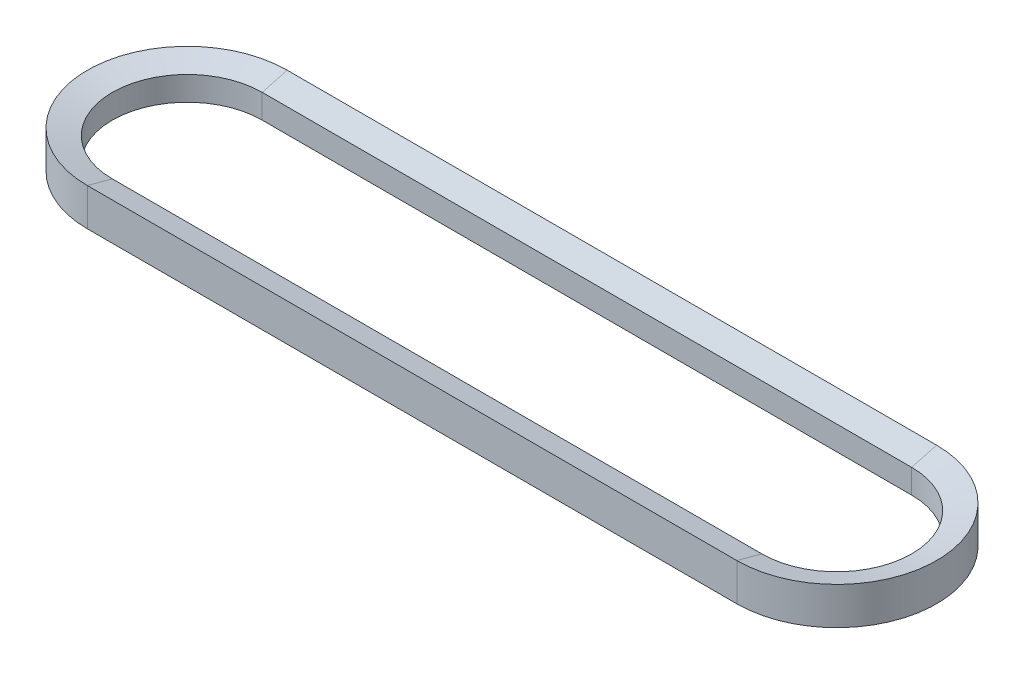
ISO-10303-21;
HEADER;
FILE_DESCRIPTION(('STEP AP214'),'2;1');
FILE_NAME('part.step','',(''),(''),'','','');
FILE_SCHEMA(('AUTOMOTIVE_DESIGN { 1 0 10303 214 1 1 1 1 }'));
ENDSEC;
DATA;
#1=APPLICATION_CONTEXT('core data for automotive mechanical design processes');
#2=APPLICATION_PROTOCOL_DEFINITION('international standard','automotive_design',2000,#1);
#3=PRODUCT_CONTEXT('',#1,'mechanical');
#4=PRODUCT('Part','Part','',(#3));
#5=PRODUCT_RELATED_PRODUCT_CATEGORY('part','',(#4));
#6=PRODUCT_DEFINITION_FORMATION('','',#4);
#7=PRODUCT_DEFINITION_CONTEXT('part definition',#1,'design');
#8=PRODUCT_DEFINITION('design','',#6,#7);
#9=PRODUCT_DEFINITION_SHAPE('','',#8);
#10=(LENGTH_UNIT() NAMED_UNIT(*) SI_UNIT(.MILLI.,.METRE.));
#11=(NAMED_UNIT(*) PLANE_ANGLE_UNIT() SI_UNIT($,.RADIAN.));
#12=(NAMED_UNIT(*) SI_UNIT($,.STERADIAN.) SOLID_ANGLE_UNIT());
#13=UNCERTAINTY_MEASURE_WITH_UNIT(LENGTH_MEASURE(1.E-05),#10,'distance_accuracy_value','');
#14=(GEOMETRIC_REPRESENTATION_CONTEXT(3) GLOBAL_UNCERTAINTY_ASSIGNED_CONTEXT((#13)) GLOBAL_UNIT_ASSIGNED_CONTEXT((#10,
#11,#12)) REPRESENTATION_CONTEXT('',''));
#15=CARTESIAN_POINT('',(0.,0.,0.));
#16=DIRECTION('',(0.,0.,1.));
#17=DIRECTION('',(1.,0.,0.));
#18=AXIS2_PLACEMENT_3D('',#15,#16,#17);
#19=CARTESIAN_POINT('',(-165.1,6.12204525612479,0.));
#20=DIRECTION('',(0.,1.,0.));
#21=DIRECTION('',(0.,0.,1.));
#22=AXIS2_PLACEMENT_3D('',#19,#20,#21);
#23=CONICAL_SURFACE('',#22,38.1,1.30899693899575);
#24=DIRECTION('',(0.,0.258819045102517,0.965925826289069));
#25=VECTOR('',#24,1.);
#26=CARTESIAN_POINT('',(-165.1,6.12204525612479,38.1));
#27=LINE('',#26,#25);
#28=CARTESIAN_POINT('',(-165.1,6.12204525612479,38.1));
#29=VERTEX_POINT('',#28);
#30=CARTESIAN_POINT('',(-165.1,9.525,50.8));
#31=VERTEX_POINT('',#30);
#32=EDGE_CURVE('E168',#29,#31,#27,.T.);
#33=ORIENTED_EDGE('',*,*,#32,.F.);
#34=CARTESIAN_POINT('',(-165.1,6.12204525612479,0.));
#35=DIRECTION('',(0.,-1.,0.));
#36=DIRECTION('',(0.,0.,-1.));
#37=AXIS2_PLACEMENT_3D('',#34,#35,#36);
#38=CIRCLE('',#37,38.1);
#39=CARTESIAN_POINT('',(-165.1,6.12204525612479,-38.1));
#40=VERTEX_POINT('',#39);
#41=EDGE_CURVE('E44',#29,#40,#38,.T.);
#42=ORIENTED_EDGE('',*,*,#41,.T.);
#43=CARTESIAN_POINT('',(-165.1,6.12204525612479,-38.1));
#44=DIRECTION('',(0.,0.258819045102517,-0.965925826289069));
#45=VECTOR('',#44,1.);
#46=LINE('',#43,#45);
#47=CARTESIAN_POINT('',(-165.1,9.525,-50.8));
#48=VERTEX_POINT('',#47);
#49=EDGE_CURVE('E279',#40,#48,#46,.T.);
#50=ORIENTED_EDGE('',*,*,#49,.T.);
#51=CARTESIAN_POINT('',(-165.1,9.525,0.));
#52=DIRECTION('',(0.,-1.,0.));
#53=DIRECTION('',(0.,0.,-1.));
#54=AXIS2_PLACEMENT_3D('',#51,#52,#53);
#55=CIRCLE('',#54,50.8);
#56=EDGE_CURVE('E11',#31,#48,#55,.T.);
#57=ORIENTED_EDGE('',*,*,#56,.F.);
#58=EDGE_LOOP('',(#33,#42,#50,#57));
#59=FACE_BOUND('',#58,.T.);
#60=ADVANCED_FACE('F33',(#59),#23,.F.);
#61=CARTESIAN_POINT('',(-165.1,0.,0.));
#62=DIRECTION('',(0.,-1.,0.));
#63=DIRECTION('',(0.,0.,-1.));
#64=AXIS2_PLACEMENT_3D('',#61,#62,#63);
#65=CYLINDRICAL_SURFACE('',#64,38.1);
#66=DIRECTION('',(0.,1.,0.));
#67=VECTOR('',#66,1.);
#68=CARTESIAN_POINT('',(-165.1,-6.12204525612478,38.1));
#69=LINE('',#68,#67);
#70=CARTESIAN_POINT('',(-165.1,-6.12204525612478,38.1));
#71=VERTEX_POINT('',#70);
#72=EDGE_CURVE('E165',#71,#29,#69,.T.);
#73=ORIENTED_EDGE('',*,*,#72,.F.);
#74=CARTESIAN_POINT('',(-165.1,-6.12204525612478,0.));
#75=DIRECTION('',(0.,-1.,0.));
#76=DIRECTION('',(0.,0.,-1.));
#77=AXIS2_PLACEMENT_3D('',#74,#75,#76);
#78=CIRCLE('',#77,38.1);
#79=CARTESIAN_POINT('',(-165.1,-6.12204525612478,-38.1));
#80=VERTEX_POINT('',#79);
#81=EDGE_CURVE('E332',#71,#80,#78,.T.);
#82=ORIENTED_EDGE('',*,*,#81,.T.);
#83=CARTESIAN_POINT('',(-165.1,-6.12204525612478,-38.1));
#84=DIRECTION('',(0.,1.,0.));
#85=VECTOR('',#84,1.);
#86=LINE('',#83,#85);
#87=EDGE_CURVE('E286',#80,#40,#86,.T.);
#88=ORIENTED_EDGE('',*,*,#87,.T.);
#89=ORIENTED_EDGE('',*,*,#41,.F.);
#90=EDGE_LOOP('',(#73,#82,#88,#89));
#91=FACE_BOUND('',#90,.T.);
#92=ADVANCED_FACE('F259',(#91),#65,.F.);
#93=CARTESIAN_POINT('',(-165.1,-9.525,0.));
#94=DIRECTION('',(0.,-1.,0.));
#95=DIRECTION('',(0.,0.,-1.));
#96=AXIS2_PLACEMENT_3D('',#93,#94,#95);
#97=CONICAL_SURFACE('',#96,50.8,1.30899693899575);
#98=DIRECTION('',(0.,0.258819045102518,-0.965925826289069));
#99=VECTOR('',#98,1.);
#100=CARTESIAN_POINT('',(-165.1,-9.525,50.8));
#101=LINE('',#100,#99);
#102=CARTESIAN_POINT('',(-165.1,-9.525,50.8));
#103=VERTEX_POINT('',#102);
#104=EDGE_CURVE('E162',#103,#71,#101,.T.);
#105=ORIENTED_EDGE('',*,*,#104,.F.);
#106=CARTESIAN_POINT('',(-165.1,-9.525,0.));
#107=DIRECTION('',(0.,-1.,0.));
#108=DIRECTION('',(0.,0.,-1.));
#109=AXIS2_PLACEMENT_3D('',#106,#107,#108);
#110=CIRCLE('',#109,50.8);
#111=CARTESIAN_POINT('',(-165.1,-9.525,-50.8));
#112=VERTEX_POINT('',#111);
#113=EDGE_CURVE('E187',#103,#112,#110,.T.);
#114=ORIENTED_EDGE('',*,*,#113,.T.);
#115=CARTESIAN_POINT('',(-165.1,-9.525,-50.8));
#116=DIRECTION('',(0.,0.258819045102518,0.965925826289069));
#117=VECTOR('',#116,1.);
#118=LINE('',#115,#117);
#119=EDGE_CURVE('E131',#112,#80,#118,.T.);
#120=ORIENTED_EDGE('',*,*,#119,.T.);
#121=ORIENTED_EDGE('',*,*,#81,.F.);
#122=EDGE_LOOP('',(#105,#114,#120,#121));
#123=FACE_BOUND('',#122,.T.);
#124=ADVANCED_FACE('F200',(#123),#97,.F.);
#125=CARTESIAN_POINT('',(-165.1,0.,0.));
#126=DIRECTION('',(0.,-1.,0.));
#127=DIRECTION('',(0.,0.,-1.));
#128=AXIS2_PLACEMENT_3D('',#125,#126,#127);
#129=CYLINDRICAL_SURFACE('',#128,50.8);
#130=DIRECTION('',(0.,-1.,0.));
#131=VECTOR('',#130,1.);
#132=CARTESIAN_POINT('',(-165.1,0.,50.8));
#133=LINE('',#132,#131);
#134=EDGE_CURVE('E159',#31,#103,#133,.T.);
#135=ORIENTED_EDGE('',*,*,#134,.F.);
#136=ORIENTED_EDGE('',*,*,#56,.T.);
#137=CARTESIAN_POINT('',(-165.1,9.525,-50.8));
#138=DIRECTION('',(0.,-1.,0.));
#139=VECTOR('',#138,1.);
#140=LINE('',#137,#139);
#141=CARTESIAN_POINT('',(-165.1,0.,-50.8));
#142=VERTEX_POINT('',#141);
#143=EDGE_CURVE('E214',#48,#142,#140,.T.);
#144=ORIENTED_EDGE('',*,*,#143,.T.);
#145=CARTESIAN_POINT('',(-165.1,0.,-50.8));
#146=DIRECTION('',(0.,-1.,0.));
#147=VECTOR('',#146,1.);
#148=LINE('',#145,#147);
#149=EDGE_CURVE('E52',#142,#112,#148,.T.);
#150=ORIENTED_EDGE('',*,*,#149,.T.);
#151=ORIENTED_EDGE('',*,*,#113,.F.);
#152=EDGE_LOOP('',(#135,#136,#144,#150,#151));
#153=FACE_BOUND('',#152,.T.);
#154=ADVANCED_FACE('F189',(#153),#129,.T.);
#155=CARTESIAN_POINT('',(165.1,6.12204525612479,38.0999999999999));
#156=DIRECTION('',(0.,-0.965925826289069,0.258819045102517));
#157=DIRECTION('',(0.,-0.258819045102517,-0.965925826289069));
#158=AXIS2_PLACEMENT_3D('',#155,#156,#157);
#159=PLANE('',#158);
#160=DIRECTION('',(0.,0.258819045102517,0.965925826289069));
#161=VECTOR('',#160,1.);
#162=CARTESIAN_POINT('',(165.1,6.12204525612479,38.0999999999999));
#163=LINE('',#162,#161);
#164=CARTESIAN_POINT('',(165.1,6.12204525612479,38.0999999999999));
#165=VERTEX_POINT('',#164);
#166=CARTESIAN_POINT('',(165.1,9.525,50.7999999999999));
#167=VERTEX_POINT('',#166);
#168=EDGE_CURVE('E116',#165,#167,#163,.T.);
#169=ORIENTED_EDGE('',*,*,#168,.F.);
#170=DIRECTION('',(-1.,0.,0.));
#171=VECTOR('',#170,1.);
#172=CARTESIAN_POINT('',(165.1,6.12204525612479,38.0999999999999));
#173=LINE('',#172,#171);
#174=EDGE_CURVE('E177',#165,#29,#173,.T.);
#175=ORIENTED_EDGE('',*,*,#174,.T.);
#176=ORIENTED_EDGE('',*,*,#32,.T.);
#177=DIRECTION('',(-1.,0.,0.));
#178=VECTOR('',#177,1.);
#179=CARTESIAN_POINT('',(165.1,9.525,50.7999999999999));
#180=LINE('',#179,#178);
#181=EDGE_CURVE('E180',#167,#31,#180,.T.);
#182=ORIENTED_EDGE('',*,*,#181,.F.);
#183=EDGE_LOOP('',(#169,#175,#176,#182));
#184=FACE_BOUND('',#183,.T.);
#185=ADVANCED_FACE('F199',(#184),#159,.F.);
#186=CARTESIAN_POINT('',(165.1,-6.12204525612478,38.0999999999999));
#187=DIRECTION('',(0.,0.,1.));
#188=DIRECTION('',(1.,0.,0.));
#189=AXIS2_PLACEMENT_3D('',#186,#187,#188);
#190=PLANE('',#189);
#191=DIRECTION('',(0.,1.,0.));
#192=VECTOR('',#191,1.);
#193=CARTESIAN_POINT('',(165.1,-6.12204525612478,38.0999999999999));
#194=LINE('',#193,#192);
#195=CARTESIAN_POINT('',(165.1,-6.12204525612478,38.0999999999999));
#196=VERTEX_POINT('',#195);
#197=EDGE_CURVE('E148',#196,#165,#194,.T.);
#198=ORIENTED_EDGE('',*,*,#197,.F.);
#199=DIRECTION('',(-1.,0.,0.));
#200=VECTOR('',#199,1.);
#201=CARTESIAN_POINT('',(165.1,-6.12204525612478,38.0999999999999));
#202=LINE('',#201,#200);
#203=EDGE_CURVE('E174',#196,#71,#202,.T.);
#204=ORIENTED_EDGE('',*,*,#203,.T.);
#205=ORIENTED_EDGE('',*,*,#72,.T.);
#206=ORIENTED_EDGE('',*,*,#174,.F.);
#207=EDGE_LOOP('',(#198,#204,#205,#206));
#208=FACE_BOUND('',#207,.T.);
#209=ADVANCED_FACE('F249',(#208),#190,.F.);
#210=CARTESIAN_POINT('',(165.1,-9.525,50.7999999999999));
#211=DIRECTION('',(0.,0.965925826289069,0.258819045102518));
#212=DIRECTION('',(0.,-0.258819045102518,0.965925826289069));
#213=AXIS2_PLACEMENT_3D('',#210,#211,#212);
#214=PLANE('',#213);
#215=DIRECTION('',(0.,0.258819045102518,-0.965925826289069));
#216=VECTOR('',#215,1.);
#217=CARTESIAN_POINT('',(165.1,-9.525,50.7999999999999));
#218=LINE('',#217,#216);
#219=CARTESIAN_POINT('',(165.1,-9.525,50.7999999999999));
#220=VERTEX_POINT('',#219);
#221=EDGE_CURVE('E146',#220,#196,#218,.T.);
#222=ORIENTED_EDGE('',*,*,#221,.F.);
#223=DIRECTION('',(-1.,0.,0.));
#224=VECTOR('',#223,1.);
#225=CARTESIAN_POINT('',(165.1,-9.525,50.7999999999999));
#226=LINE('',#225,#224);
#227=EDGE_CURVE('E171',#220,#103,#226,.T.);
#228=ORIENTED_EDGE('',*,*,#227,.T.);
#229=ORIENTED_EDGE('',*,*,#104,.T.);
#230=ORIENTED_EDGE('',*,*,#203,.F.);
#231=EDGE_LOOP('',(#222,#228,#229,#230));
#232=FACE_BOUND('',#231,.T.);
#233=ADVANCED_FACE('F246',(#232),#214,.F.);
#234=CARTESIAN_POINT('',(165.1,0.,50.7999999999999));
#235=DIRECTION('',(0.,0.,-1.));
#236=DIRECTION('',(-1.,0.,0.));
#237=AXIS2_PLACEMENT_3D('',#234,#235,#236);
#238=PLANE('',#237);
#239=DIRECTION('',(0.,-1.,0.));
#240=VECTOR('',#239,1.);
#241=CARTESIAN_POINT('',(165.1,0.,50.7999999999999));
#242=LINE('',#241,#240);
#243=EDGE_CURVE('E112',#167,#220,#242,.T.);
#244=ORIENTED_EDGE('',*,*,#243,.F.);
#245=ORIENTED_EDGE('',*,*,#181,.T.);
#246=ORIENTED_EDGE('',*,*,#134,.T.);
#247=ORIENTED_EDGE('',*,*,#227,.F.);
#248=EDGE_LOOP('',(#244,#245,#246,#247));
#249=FACE_BOUND('',#248,.T.);
#250=ADVANCED_FACE('F242',(#249),#238,.F.);
#251=CARTESIAN_POINT('',(165.1,6.12204525612479,0.));
#252=DIRECTION('',(0.,1.,0.));
#253=DIRECTION('',(0.,0.,1.));
#254=AXIS2_PLACEMENT_3D('',#251,#252,#253);
#255=CONICAL_SURFACE('',#254,38.1,1.30899693899575);
#256=DIRECTION('',(0.,0.258819045102517,-0.965925826289069));
#257=VECTOR('',#256,1.);
#258=CARTESIAN_POINT('',(165.1,6.12204525612479,-38.1000000000001));
#259=LINE('',#258,#257);
#260=CARTESIAN_POINT('',(165.1,6.12204525612479,-38.1000000000001));
#261=VERTEX_POINT('',#260);
#262=CARTESIAN_POINT('',(165.1,9.525,-50.8000000000001));
#263=VERTEX_POINT('',#262);
#264=EDGE_CURVE('E134',#261,#263,#259,.T.);
#265=ORIENTED_EDGE('',*,*,#264,.F.);
#266=CARTESIAN_POINT('',(165.1,6.12204525612479,0.));
#267=DIRECTION('',(0.,-1.,0.));
#268=DIRECTION('',(0.,0.,-1.));
#269=AXIS2_PLACEMENT_3D('',#266,#267,#268);
#270=CIRCLE('',#269,38.1);
#271=EDGE_CURVE('E154',#261,#165,#270,.T.);
#272=ORIENTED_EDGE('',*,*,#271,.T.);
#273=ORIENTED_EDGE('',*,*,#168,.T.);
#274=CARTESIAN_POINT('',(165.1,9.525,0.));
#275=DIRECTION('',(0.,-1.,0.));
#276=DIRECTION('',(0.,0.,-1.));
#277=AXIS2_PLACEMENT_3D('',#274,#275,#276);
#278=CIRCLE('',#277,50.8);
#279=EDGE_CURVE('E157',#263,#167,#278,.T.);
#280=ORIENTED_EDGE('',*,*,#279,.F.);
#281=EDGE_LOOP('',(#265,#272,#273,#280));
#282=FACE_BOUND('',#281,.T.);
#283=ADVANCED_FACE('F238',(#282),#255,.F.);
#284=CARTESIAN_POINT('',(165.1,0.,0.));
#285=DIRECTION('',(0.,-1.,0.));
#286=DIRECTION('',(0.,0.,-1.));
#287=AXIS2_PLACEMENT_3D('',#284,#285,#286);
#288=CYLINDRICAL_SURFACE('',#287,38.1);
#289=DIRECTION('',(0.,1.,0.));
#290=VECTOR('',#289,1.);
#291=CARTESIAN_POINT('',(165.1,-6.12204525612478,-38.1000000000001));
#292=LINE('',#291,#290);
#293=CARTESIAN_POINT('',(165.1,-6.12204525612478,-38.1000000000001));
#294=VERTEX_POINT('',#293);
#295=EDGE_CURVE('E125',#294,#261,#292,.T.);
#296=ORIENTED_EDGE('',*,*,#295,.F.);
#297=CARTESIAN_POINT('',(165.1,-6.12204525612478,0.));
#298=DIRECTION('',(0.,-1.,0.));
#299=DIRECTION('',(0.,0.,-1.));
#300=AXIS2_PLACEMENT_3D('',#297,#298,#299);
#301=CIRCLE('',#300,38.1);
#302=EDGE_CURVE('E115',#294,#196,#301,.T.);
#303=ORIENTED_EDGE('',*,*,#302,.T.);
#304=ORIENTED_EDGE('',*,*,#197,.T.);
#305=ORIENTED_EDGE('',*,*,#271,.F.);
#306=EDGE_LOOP('',(#296,#303,#304,#305));
#307=FACE_BOUND('',#306,.T.);
#308=ADVANCED_FACE('F235',(#307),#288,.F.);
#309=CARTESIAN_POINT('',(165.1,-9.525,0.));
#310=DIRECTION('',(0.,-1.,0.));
#311=DIRECTION('',(0.,0.,-1.));
#312=AXIS2_PLACEMENT_3D('',#309,#310,#311);
#313=CONICAL_SURFACE('',#312,50.8,1.30899693899575);
#314=DIRECTION('',(0.,0.258819045102518,0.965925826289069));
#315=VECTOR('',#314,1.);
#316=CARTESIAN_POINT('',(165.1,-9.525,-50.8000000000001));
#317=LINE('',#316,#315);
#318=CARTESIAN_POINT('',(165.1,-9.525,-50.8000000000001));
#319=VERTEX_POINT('',#318);
#320=EDGE_CURVE('E119',#319,#294,#317,.T.);
#321=ORIENTED_EDGE('',*,*,#320,.F.);
#322=CARTESIAN_POINT('',(165.1,-9.525,0.));
#323=DIRECTION('',(0.,-1.,0.));
#324=DIRECTION('',(0.,0.,-1.));
#325=AXIS2_PLACEMENT_3D('',#322,#323,#324);
#326=CIRCLE('',#325,50.8);
#327=EDGE_CURVE('E105',#319,#220,#326,.T.);
#328=ORIENTED_EDGE('',*,*,#327,.T.);
#329=ORIENTED_EDGE('',*,*,#221,.T.);
#330=ORIENTED_EDGE('',*,*,#302,.F.);
#331=EDGE_LOOP('',(#321,#328,#329,#330));
#332=FACE_BOUND('',#331,.T.);
#333=ADVANCED_FACE('F121',(#332),#313,.F.);
#334=CARTESIAN_POINT('',(165.1,0.,0.));
#335=DIRECTION('',(0.,-1.,0.));
#336=DIRECTION('',(0.,0.,-1.));
#337=AXIS2_PLACEMENT_3D('',#334,#335,#336);
#338=CYLINDRICAL_SURFACE('',#337,50.8);
#339=DIRECTION('',(0.,-1.,0.));
#340=VECTOR('',#339,1.);
#341=CARTESIAN_POINT('',(165.1,0.,-50.8000000000001));
#342=LINE('',#341,#340);
#343=EDGE_CURVE('E110',#263,#319,#342,.T.);
#344=ORIENTED_EDGE('',*,*,#343,.F.);
#345=ORIENTED_EDGE('',*,*,#279,.T.);
#346=ORIENTED_EDGE('',*,*,#243,.T.);
#347=ORIENTED_EDGE('',*,*,#327,.F.);
#348=EDGE_LOOP('',(#344,#345,#346,#347));
#349=FACE_BOUND('',#348,.T.);
#350=ADVANCED_FACE('F107',(#349),#338,.T.);
#351=CARTESIAN_POINT('',(165.1,0.,-50.8000000000001));
#352=DIRECTION('',(0.,0.,-1.));
#353=DIRECTION('',(-1.,0.,0.));
#354=AXIS2_PLACEMENT_3D('',#351,#352,#353);
#355=PLANE('',#354);
#356=ORIENTED_EDGE('',*,*,#143,.F.);
#357=DIRECTION('',(-1.,0.,0.));
#358=VECTOR('',#357,1.);
#359=CARTESIAN_POINT('',(165.1,9.525,-50.8000000000001));
#360=LINE('',#359,#358);
#361=EDGE_CURVE('E138',#263,#48,#360,.T.);
#362=ORIENTED_EDGE('',*,*,#361,.F.);
#363=ORIENTED_EDGE('',*,*,#343,.T.);
#364=DIRECTION('',(-1.,0.,0.));
#365=VECTOR('',#364,1.);
#366=CARTESIAN_POINT('',(165.1,-9.525,-50.8000000000001));
#367=LINE('',#366,#365);
#368=EDGE_CURVE('E128',#319,#112,#367,.T.);
#369=ORIENTED_EDGE('',*,*,#368,.T.);
#370=ORIENTED_EDGE('',*,*,#149,.F.);
#371=EDGE_LOOP('',(#356,#362,#363,#369,#370));
#372=FACE_BOUND('',#371,.T.);
#373=ADVANCED_FACE('F137',(#372),#355,.T.);
#374=CARTESIAN_POINT('',(165.1,6.12204525612479,-38.1000000000001));
#375=DIRECTION('',(0.,0.965925826289069,0.258819045102517));
#376=DIRECTION('',(0.,-0.258819045102517,0.965925826289069));
#377=AXIS2_PLACEMENT_3D('',#374,#375,#376);
#378=PLANE('',#377);
#379=ORIENTED_EDGE('',*,*,#49,.F.);
#380=DIRECTION('',(-1.,0.,0.));
#381=VECTOR('',#380,1.);
#382=CARTESIAN_POINT('',(165.1,6.12204525612479,-38.1000000000001));
#383=LINE('',#382,#381);
#384=EDGE_CURVE('E277',#261,#40,#383,.T.);
#385=ORIENTED_EDGE('',*,*,#384,.F.);
#386=ORIENTED_EDGE('',*,*,#264,.T.);
#387=ORIENTED_EDGE('',*,*,#361,.T.);
#388=EDGE_LOOP('',(#379,#385,#386,#387));
#389=FACE_BOUND('',#388,.T.);
#390=ADVANCED_FACE('F278',(#389),#378,.T.);
#391=CARTESIAN_POINT('',(165.1,-6.12204525612478,-38.1000000000001));
#392=DIRECTION('',(0.,0.,1.));
#393=DIRECTION('',(1.,0.,0.));
#394=AXIS2_PLACEMENT_3D('',#391,#392,#393);
#395=PLANE('',#394);
#396=ORIENTED_EDGE('',*,*,#87,.F.);
#397=DIRECTION('',(-1.,0.,0.));
#398=VECTOR('',#397,1.);
#399=CARTESIAN_POINT('',(165.1,-6.12204525612478,-38.1000000000001));
#400=LINE('',#399,#398);
#401=EDGE_CURVE('E133',#294,#80,#400,.T.);
#402=ORIENTED_EDGE('',*,*,#401,.F.);
#403=ORIENTED_EDGE('',*,*,#295,.T.);
#404=ORIENTED_EDGE('',*,*,#384,.T.);
#405=EDGE_LOOP('',(#396,#402,#403,#404));
#406=FACE_BOUND('',#405,.T.);
#407=ADVANCED_FACE('F228',(#406),#395,.T.);
#408=CARTESIAN_POINT('',(165.1,-9.525,-50.8000000000001));
#409=DIRECTION('',(0.,-0.965925826289069,0.258819045102518));
#410=DIRECTION('',(0.,-0.258819045102518,-0.965925826289069));
#411=AXIS2_PLACEMENT_3D('',#408,#409,#410);
#412=PLANE('',#411);
#413=ORIENTED_EDGE('',*,*,#119,.F.);
#414=ORIENTED_EDGE('',*,*,#368,.F.);
#415=ORIENTED_EDGE('',*,*,#320,.T.);
#416=ORIENTED_EDGE('',*,*,#401,.T.);
#417=EDGE_LOOP('',(#413,#414,#415,#416));
#418=FACE_BOUND('',#417,.T.);
#419=ADVANCED_FACE('F129',(#418),#412,.T.);
#420=CLOSED_SHELL('',(#60,#92,#124,#154,#185,#209,#233,#250,#283,#308,#333,#350,#373,#390,#407,#419));
#421=MANIFOLD_SOLID_BREP('B2',#420);
#422=ADVANCED_BREP_SHAPE_REPRESENTATION('',(#18,#421),#14);
#423=SHAPE_DEFINITION_REPRESENTATION(#9,#422);
ENDSEC;
END-ISO-10303-21;
